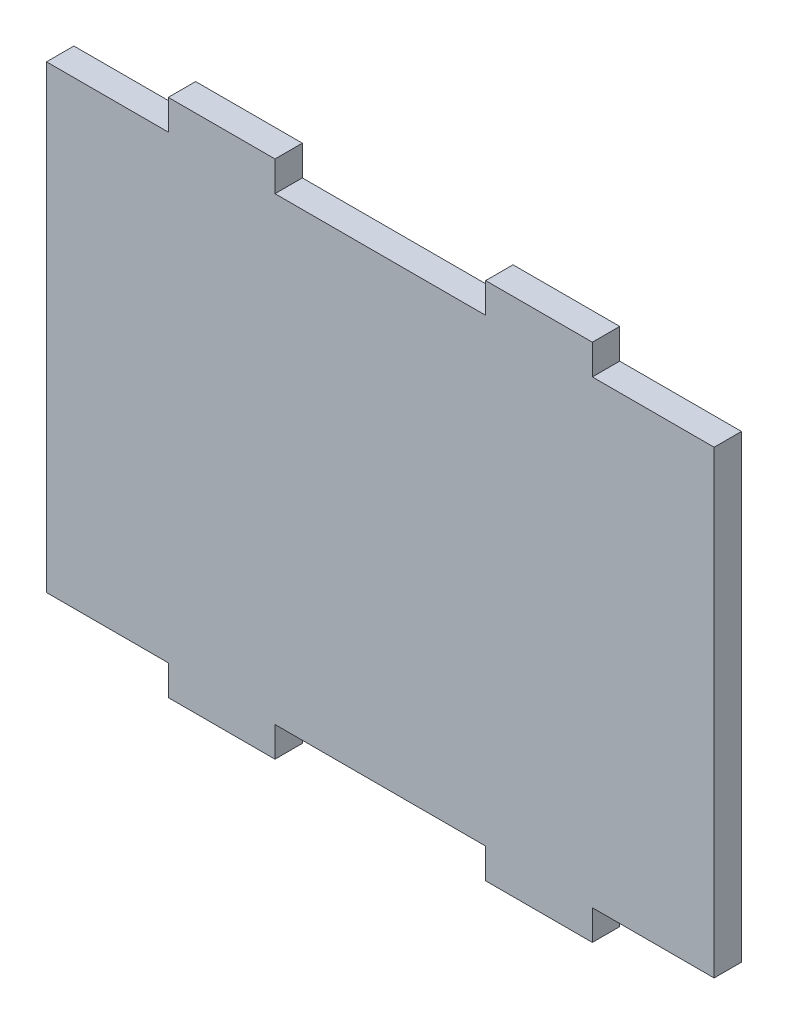
ISO-10303-21;
HEADER;
FILE_DESCRIPTION(('STEP AP214'),'2;1');
FILE_NAME('part.step','',(''),(''),'','','');
FILE_SCHEMA(('AUTOMOTIVE_DESIGN { 1 0 10303 214 1 1 1 1 }'));
ENDSEC;
DATA;
#1=APPLICATION_CONTEXT('core data for automotive mechanical design processes');
#2=APPLICATION_PROTOCOL_DEFINITION('international standard','automotive_design',2000,#1);
#3=PRODUCT_CONTEXT('',#1,'mechanical');
#4=PRODUCT('Part','Part','',(#3));
#5=PRODUCT_RELATED_PRODUCT_CATEGORY('part','',(#4));
#6=PRODUCT_DEFINITION_FORMATION('','',#4);
#7=PRODUCT_DEFINITION_CONTEXT('part definition',#1,'design');
#8=PRODUCT_DEFINITION('design','',#6,#7);
#9=PRODUCT_DEFINITION_SHAPE('','',#8);
#10=(LENGTH_UNIT() NAMED_UNIT(*) SI_UNIT(.MILLI.,.METRE.));
#11=(NAMED_UNIT(*) PLANE_ANGLE_UNIT() SI_UNIT($,.RADIAN.));
#12=(NAMED_UNIT(*) SI_UNIT($,.STERADIAN.) SOLID_ANGLE_UNIT());
#13=UNCERTAINTY_MEASURE_WITH_UNIT(LENGTH_MEASURE(1.E-05),#10,'distance_accuracy_value','');
#14=(GEOMETRIC_REPRESENTATION_CONTEXT(3) GLOBAL_UNCERTAINTY_ASSIGNED_CONTEXT((#13)) GLOBAL_UNIT_ASSIGNED_CONTEXT((#10,
#11,#12)) REPRESENTATION_CONTEXT('',''));
#15=CARTESIAN_POINT('',(0.,0.,0.));
#16=DIRECTION('',(0.,0.,1.));
#17=DIRECTION('',(1.,0.,0.));
#18=AXIS2_PLACEMENT_3D('',#15,#16,#17);
#19=CARTESIAN_POINT('',(-19.25,47.5,5.));
#20=DIRECTION('',(-1.,0.,0.));
#21=DIRECTION('',(0.,0.,1.));
#22=AXIS2_PLACEMENT_3D('',#19,#20,#21);
#23=PLANE('',#22);
#24=DIRECTION('',(0.,1.,0.));
#25=VECTOR('',#24,1.);
#26=CARTESIAN_POINT('',(-19.25,47.5,0.));
#27=LINE('',#26,#25);
#28=CARTESIAN_POINT('',(-19.25,42.,0.));
#29=VERTEX_POINT('',#28);
#30=CARTESIAN_POINT('',(-19.25,47.5,0.));
#31=VERTEX_POINT('',#30);
#32=EDGE_CURVE('E201',#29,#31,#27,.T.);
#33=ORIENTED_EDGE('',*,*,#32,.T.);
#34=DIRECTION('',(0.,0.,-1.));
#35=VECTOR('',#34,1.);
#36=CARTESIAN_POINT('',(-19.25,47.5,5.));
#37=LINE('',#36,#35);
#38=CARTESIAN_POINT('',(-19.25,47.5,5.));
#39=VERTEX_POINT('',#38);
#40=EDGE_CURVE('E11',#39,#31,#37,.T.);
#41=ORIENTED_EDGE('',*,*,#40,.F.);
#42=DIRECTION('',(0.,1.,0.));
#43=VECTOR('',#42,1.);
#44=CARTESIAN_POINT('',(-19.25,47.5,5.));
#45=LINE('',#44,#43);
#46=CARTESIAN_POINT('',(-19.25,42.,5.));
#47=VERTEX_POINT('',#46);
#48=EDGE_CURVE('E239',#47,#39,#45,.T.);
#49=ORIENTED_EDGE('',*,*,#48,.F.);
#50=DIRECTION('',(0.,0.,-1.));
#51=VECTOR('',#50,1.);
#52=CARTESIAN_POINT('',(-19.25,42.,5.));
#53=LINE('',#52,#51);
#54=EDGE_CURVE('E197',#47,#29,#53,.T.);
#55=ORIENTED_EDGE('',*,*,#54,.T.);
#56=EDGE_LOOP('',(#33,#41,#49,#55));
#57=FACE_BOUND('',#56,.T.);
#58=ADVANCED_FACE('F33',(#57),#23,.F.);
#59=CARTESIAN_POINT('',(-38.75,47.5,5.));
#60=DIRECTION('',(0.,-1.,0.));
#61=DIRECTION('',(0.,0.,-1.));
#62=AXIS2_PLACEMENT_3D('',#59,#60,#61);
#63=PLANE('',#62);
#64=DIRECTION('',(-1.,0.,0.));
#65=VECTOR('',#64,1.);
#66=CARTESIAN_POINT('',(-38.75,47.5,0.));
#67=LINE('',#66,#65);
#68=CARTESIAN_POINT('',(-38.75,47.5,0.));
#69=VERTEX_POINT('',#68);
#70=EDGE_CURVE('E204',#31,#69,#67,.T.);
#71=ORIENTED_EDGE('',*,*,#70,.T.);
#72=DIRECTION('',(0.,0.,-1.));
#73=VECTOR('',#72,1.);
#74=CARTESIAN_POINT('',(-38.75,47.5,5.));
#75=LINE('',#74,#73);
#76=CARTESIAN_POINT('',(-38.75,47.5,5.));
#77=VERTEX_POINT('',#76);
#78=EDGE_CURVE('E41',#77,#69,#75,.T.);
#79=ORIENTED_EDGE('',*,*,#78,.F.);
#80=DIRECTION('',(-1.,0.,0.));
#81=VECTOR('',#80,1.);
#82=CARTESIAN_POINT('',(-38.75,47.5,5.));
#83=LINE('',#82,#81);
#84=EDGE_CURVE('E128',#39,#77,#83,.T.);
#85=ORIENTED_EDGE('',*,*,#84,.F.);
#86=ORIENTED_EDGE('',*,*,#40,.T.);
#87=EDGE_LOOP('',(#71,#79,#85,#86));
#88=FACE_BOUND('',#87,.T.);
#89=ADVANCED_FACE('F357',(#88),#63,.F.);
#90=CARTESIAN_POINT('',(-38.75,42.,5.));
#91=DIRECTION('',(1.,0.,0.));
#92=DIRECTION('',(0.,0.,-1.));
#93=AXIS2_PLACEMENT_3D('',#90,#91,#92);
#94=PLANE('',#93);
#95=DIRECTION('',(0.,-1.,0.));
#96=VECTOR('',#95,1.);
#97=CARTESIAN_POINT('',(-38.75,42.,0.));
#98=LINE('',#97,#96);
#99=CARTESIAN_POINT('',(-38.75,42.,0.));
#100=VERTEX_POINT('',#99);
#101=EDGE_CURVE('E206',#69,#100,#98,.T.);
#102=ORIENTED_EDGE('',*,*,#101,.T.);
#103=DIRECTION('',(0.,0.,-1.));
#104=VECTOR('',#103,1.);
#105=CARTESIAN_POINT('',(-38.75,42.,5.));
#106=LINE('',#105,#104);
#107=CARTESIAN_POINT('',(-38.75,42.,5.));
#108=VERTEX_POINT('',#107);
#109=EDGE_CURVE('E282',#108,#100,#106,.T.);
#110=ORIENTED_EDGE('',*,*,#109,.F.);
#111=DIRECTION('',(0.,-1.,0.));
#112=VECTOR('',#111,1.);
#113=CARTESIAN_POINT('',(-38.75,42.,5.));
#114=LINE('',#113,#112);
#115=EDGE_CURVE('E290',#77,#108,#114,.T.);
#116=ORIENTED_EDGE('',*,*,#115,.F.);
#117=ORIENTED_EDGE('',*,*,#78,.T.);
#118=EDGE_LOOP('',(#102,#110,#116,#117));
#119=FACE_BOUND('',#118,.T.);
#120=ADVANCED_FACE('F288',(#119),#94,.F.);
#121=CARTESIAN_POINT('',(-61.,42.,5.));
#122=DIRECTION('',(0.,-1.,0.));
#123=DIRECTION('',(1.,0.,0.));
#124=AXIS2_PLACEMENT_3D('',#121,#122,#123);
#125=PLANE('',#124);
#126=DIRECTION('',(-1.,0.,0.));
#127=VECTOR('',#126,1.);
#128=CARTESIAN_POINT('',(-61.,42.,0.));
#129=LINE('',#128,#127);
#130=CARTESIAN_POINT('',(-61.,42.,0.));
#131=VERTEX_POINT('',#130);
#132=EDGE_CURVE('E208',#100,#131,#129,.T.);
#133=ORIENTED_EDGE('',*,*,#132,.T.);
#134=DIRECTION('',(0.,0.,-1.));
#135=VECTOR('',#134,1.);
#136=CARTESIAN_POINT('',(-61.,42.,5.));
#137=LINE('',#136,#135);
#138=CARTESIAN_POINT('',(-61.,42.,5.));
#139=VERTEX_POINT('',#138);
#140=EDGE_CURVE('E279',#139,#131,#137,.T.);
#141=ORIENTED_EDGE('',*,*,#140,.F.);
#142=DIRECTION('',(-1.,0.,0.));
#143=VECTOR('',#142,1.);
#144=CARTESIAN_POINT('',(-61.,42.,5.));
#145=LINE('',#144,#143);
#146=EDGE_CURVE('E308',#108,#139,#145,.T.);
#147=ORIENTED_EDGE('',*,*,#146,.F.);
#148=ORIENTED_EDGE('',*,*,#109,.T.);
#149=EDGE_LOOP('',(#133,#141,#147,#148));
#150=FACE_BOUND('',#149,.T.);
#151=ADVANCED_FACE('F299',(#150),#125,.F.);
#152=CARTESIAN_POINT('',(-61.,-42.,5.));
#153=DIRECTION('',(1.,0.,0.));
#154=DIRECTION('',(0.,0.,-1.));
#155=AXIS2_PLACEMENT_3D('',#152,#153,#154);
#156=PLANE('',#155);
#157=DIRECTION('',(0.,-1.,0.));
#158=VECTOR('',#157,1.);
#159=CARTESIAN_POINT('',(-61.,-42.,0.));
#160=LINE('',#159,#158);
#161=CARTESIAN_POINT('',(-61.,-42.,0.));
#162=VERTEX_POINT('',#161);
#163=EDGE_CURVE('E210',#131,#162,#160,.T.);
#164=ORIENTED_EDGE('',*,*,#163,.T.);
#165=DIRECTION('',(0.,0.,-1.));
#166=VECTOR('',#165,1.);
#167=CARTESIAN_POINT('',(-61.,-42.,5.));
#168=LINE('',#167,#166);
#169=CARTESIAN_POINT('',(-61.,-42.,5.));
#170=VERTEX_POINT('',#169);
#171=EDGE_CURVE('E276',#170,#162,#168,.T.);
#172=ORIENTED_EDGE('',*,*,#171,.F.);
#173=DIRECTION('',(0.,-1.,0.));
#174=VECTOR('',#173,1.);
#175=CARTESIAN_POINT('',(-61.,-42.,5.));
#176=LINE('',#175,#174);
#177=EDGE_CURVE('E305',#139,#170,#176,.T.);
#178=ORIENTED_EDGE('',*,*,#177,.F.);
#179=ORIENTED_EDGE('',*,*,#140,.T.);
#180=EDGE_LOOP('',(#164,#172,#178,#179));
#181=FACE_BOUND('',#180,.T.);
#182=ADVANCED_FACE('F303',(#181),#156,.F.);
#183=CARTESIAN_POINT('',(-61.,-42.,5.));
#184=DIRECTION('',(0.,1.,0.));
#185=DIRECTION('',(0.,0.,1.));
#186=AXIS2_PLACEMENT_3D('',#183,#184,#185);
#187=PLANE('',#186);
#188=DIRECTION('',(1.,0.,0.));
#189=VECTOR('',#188,1.);
#190=CARTESIAN_POINT('',(-61.,-42.,0.));
#191=LINE('',#190,#189);
#192=CARTESIAN_POINT('',(-38.75,-42.,0.));
#193=VERTEX_POINT('',#192);
#194=EDGE_CURVE('E212',#162,#193,#191,.T.);
#195=ORIENTED_EDGE('',*,*,#194,.T.);
#196=DIRECTION('',(0.,0.,-1.));
#197=VECTOR('',#196,1.);
#198=CARTESIAN_POINT('',(-38.75,-42.,5.));
#199=LINE('',#198,#197);
#200=CARTESIAN_POINT('',(-38.75,-42.,5.));
#201=VERTEX_POINT('',#200);
#202=EDGE_CURVE('E273',#201,#193,#199,.T.);
#203=ORIENTED_EDGE('',*,*,#202,.F.);
#204=DIRECTION('',(1.,0.,0.));
#205=VECTOR('',#204,1.);
#206=CARTESIAN_POINT('',(-61.,-42.,5.));
#207=LINE('',#206,#205);
#208=EDGE_CURVE('E307',#170,#201,#207,.T.);
#209=ORIENTED_EDGE('',*,*,#208,.F.);
#210=ORIENTED_EDGE('',*,*,#171,.T.);
#211=EDGE_LOOP('',(#195,#203,#209,#210));
#212=FACE_BOUND('',#211,.T.);
#213=ADVANCED_FACE('F370',(#212),#187,.F.);
#214=CARTESIAN_POINT('',(-38.75,-42.,5.));
#215=DIRECTION('',(1.,0.,0.));
#216=DIRECTION('',(0.,0.,-1.));
#217=AXIS2_PLACEMENT_3D('',#214,#215,#216);
#218=PLANE('',#217);
#219=DIRECTION('',(0.,-1.,0.));
#220=VECTOR('',#219,1.);
#221=CARTESIAN_POINT('',(-38.75,-42.,0.));
#222=LINE('',#221,#220);
#223=CARTESIAN_POINT('',(-38.75,-47.5,0.));
#224=VERTEX_POINT('',#223);
#225=EDGE_CURVE('E214',#193,#224,#222,.T.);
#226=ORIENTED_EDGE('',*,*,#225,.T.);
#227=DIRECTION('',(0.,0.,-1.));
#228=VECTOR('',#227,1.);
#229=CARTESIAN_POINT('',(-38.75,-47.5,5.));
#230=LINE('',#229,#228);
#231=CARTESIAN_POINT('',(-38.75,-47.5,5.));
#232=VERTEX_POINT('',#231);
#233=EDGE_CURVE('E270',#232,#224,#230,.T.);
#234=ORIENTED_EDGE('',*,*,#233,.F.);
#235=DIRECTION('',(0.,-1.,0.));
#236=VECTOR('',#235,1.);
#237=CARTESIAN_POINT('',(-38.75,-42.,5.));
#238=LINE('',#237,#236);
#239=EDGE_CURVE('E310',#201,#232,#238,.T.);
#240=ORIENTED_EDGE('',*,*,#239,.F.);
#241=ORIENTED_EDGE('',*,*,#202,.T.);
#242=EDGE_LOOP('',(#226,#234,#240,#241));
#243=FACE_BOUND('',#242,.T.);
#244=ADVANCED_FACE('F373',(#243),#218,.F.);
#245=CARTESIAN_POINT('',(-38.75,-47.5,5.));
#246=DIRECTION('',(0.,1.,0.));
#247=DIRECTION('',(0.,0.,1.));
#248=AXIS2_PLACEMENT_3D('',#245,#246,#247);
#249=PLANE('',#248);
#250=DIRECTION('',(1.,0.,0.));
#251=VECTOR('',#250,1.);
#252=CARTESIAN_POINT('',(-38.75,-47.5,0.));
#253=LINE('',#252,#251);
#254=CARTESIAN_POINT('',(-19.25,-47.5,0.));
#255=VERTEX_POINT('',#254);
#256=EDGE_CURVE('E216',#224,#255,#253,.T.);
#257=ORIENTED_EDGE('',*,*,#256,.T.);
#258=DIRECTION('',(0.,0.,-1.));
#259=VECTOR('',#258,1.);
#260=CARTESIAN_POINT('',(-19.25,-47.5,5.));
#261=LINE('',#260,#259);
#262=CARTESIAN_POINT('',(-19.25,-47.5,5.));
#263=VERTEX_POINT('',#262);
#264=EDGE_CURVE('E267',#263,#255,#261,.T.);
#265=ORIENTED_EDGE('',*,*,#264,.F.);
#266=DIRECTION('',(1.,0.,0.));
#267=VECTOR('',#266,1.);
#268=CARTESIAN_POINT('',(-38.75,-47.5,5.));
#269=LINE('',#268,#267);
#270=EDGE_CURVE('E316',#232,#263,#269,.T.);
#271=ORIENTED_EDGE('',*,*,#270,.F.);
#272=ORIENTED_EDGE('',*,*,#233,.T.);
#273=EDGE_LOOP('',(#257,#265,#271,#272));
#274=FACE_BOUND('',#273,.T.);
#275=ADVANCED_FACE('F377',(#274),#249,.F.);
#276=CARTESIAN_POINT('',(-19.25,-47.5,5.));
#277=DIRECTION('',(-1.,0.,0.));
#278=DIRECTION('',(0.,0.,1.));
#279=AXIS2_PLACEMENT_3D('',#276,#277,#278);
#280=PLANE('',#279);
#281=DIRECTION('',(0.,1.,0.));
#282=VECTOR('',#281,1.);
#283=CARTESIAN_POINT('',(-19.25,-47.5,0.));
#284=LINE('',#283,#282);
#285=CARTESIAN_POINT('',(-19.25,-42.,0.));
#286=VERTEX_POINT('',#285);
#287=EDGE_CURVE('E218',#255,#286,#284,.T.);
#288=ORIENTED_EDGE('',*,*,#287,.T.);
#289=DIRECTION('',(0.,0.,-1.));
#290=VECTOR('',#289,1.);
#291=CARTESIAN_POINT('',(-19.25,-42.,5.));
#292=LINE('',#291,#290);
#293=CARTESIAN_POINT('',(-19.25,-42.,5.));
#294=VERTEX_POINT('',#293);
#295=EDGE_CURVE('E264',#294,#286,#292,.T.);
#296=ORIENTED_EDGE('',*,*,#295,.F.);
#297=DIRECTION('',(0.,1.,0.));
#298=VECTOR('',#297,1.);
#299=CARTESIAN_POINT('',(-19.25,-47.5,5.));
#300=LINE('',#299,#298);
#301=EDGE_CURVE('E318',#263,#294,#300,.T.);
#302=ORIENTED_EDGE('',*,*,#301,.F.);
#303=ORIENTED_EDGE('',*,*,#264,.T.);
#304=EDGE_LOOP('',(#288,#296,#302,#303));
#305=FACE_BOUND('',#304,.T.);
#306=ADVANCED_FACE('F381',(#305),#280,.F.);
#307=CARTESIAN_POINT('',(-19.25,-42.,5.));
#308=DIRECTION('',(0.,1.,0.));
#309=DIRECTION('',(0.,0.,1.));
#310=AXIS2_PLACEMENT_3D('',#307,#308,#309);
#311=PLANE('',#310);
#312=DIRECTION('',(1.,0.,0.));
#313=VECTOR('',#312,1.);
#314=CARTESIAN_POINT('',(-19.25,-42.,0.));
#315=LINE('',#314,#313);
#316=CARTESIAN_POINT('',(19.25,-42.,0.));
#317=VERTEX_POINT('',#316);
#318=EDGE_CURVE('E220',#286,#317,#315,.T.);
#319=ORIENTED_EDGE('',*,*,#318,.T.);
#320=DIRECTION('',(0.,0.,-1.));
#321=VECTOR('',#320,1.);
#322=CARTESIAN_POINT('',(19.25,-42.,5.));
#323=LINE('',#322,#321);
#324=CARTESIAN_POINT('',(19.25,-42.,5.));
#325=VERTEX_POINT('',#324);
#326=EDGE_CURVE('E261',#325,#317,#323,.T.);
#327=ORIENTED_EDGE('',*,*,#326,.F.);
#328=DIRECTION('',(1.,0.,0.));
#329=VECTOR('',#328,1.);
#330=CARTESIAN_POINT('',(-19.25,-42.,5.));
#331=LINE('',#330,#329);
#332=EDGE_CURVE('E320',#294,#325,#331,.T.);
#333=ORIENTED_EDGE('',*,*,#332,.F.);
#334=ORIENTED_EDGE('',*,*,#295,.T.);
#335=EDGE_LOOP('',(#319,#327,#333,#334));
#336=FACE_BOUND('',#335,.T.);
#337=ADVANCED_FACE('F385',(#336),#311,.F.);
#338=CARTESIAN_POINT('',(19.25,-47.5,5.));
#339=DIRECTION('',(1.,0.,0.));
#340=DIRECTION('',(0.,0.,-1.));
#341=AXIS2_PLACEMENT_3D('',#338,#339,#340);
#342=PLANE('',#341);
#343=DIRECTION('',(0.,-1.,0.));
#344=VECTOR('',#343,1.);
#345=CARTESIAN_POINT('',(19.25,-47.5,0.));
#346=LINE('',#345,#344);
#347=CARTESIAN_POINT('',(19.25,-47.5,0.));
#348=VERTEX_POINT('',#347);
#349=EDGE_CURVE('E222',#317,#348,#346,.T.);
#350=ORIENTED_EDGE('',*,*,#349,.T.);
#351=DIRECTION('',(0.,0.,-1.));
#352=VECTOR('',#351,1.);
#353=CARTESIAN_POINT('',(19.25,-47.5,5.));
#354=LINE('',#353,#352);
#355=CARTESIAN_POINT('',(19.25,-47.5,5.));
#356=VERTEX_POINT('',#355);
#357=EDGE_CURVE('E258',#356,#348,#354,.T.);
#358=ORIENTED_EDGE('',*,*,#357,.F.);
#359=DIRECTION('',(0.,-1.,0.));
#360=VECTOR('',#359,1.);
#361=CARTESIAN_POINT('',(19.25,-47.5,5.));
#362=LINE('',#361,#360);
#363=EDGE_CURVE('E322',#325,#356,#362,.T.);
#364=ORIENTED_EDGE('',*,*,#363,.F.);
#365=ORIENTED_EDGE('',*,*,#326,.T.);
#366=EDGE_LOOP('',(#350,#358,#364,#365));
#367=FACE_BOUND('',#366,.T.);
#368=ADVANCED_FACE('F389',(#367),#342,.F.);
#369=CARTESIAN_POINT('',(38.75,-47.5,5.));
#370=DIRECTION('',(0.,1.,0.));
#371=DIRECTION('',(0.,0.,1.));
#372=AXIS2_PLACEMENT_3D('',#369,#370,#371);
#373=PLANE('',#372);
#374=DIRECTION('',(1.,0.,0.));
#375=VECTOR('',#374,1.);
#376=CARTESIAN_POINT('',(38.75,-47.5,0.));
#377=LINE('',#376,#375);
#378=CARTESIAN_POINT('',(38.75,-47.5,0.));
#379=VERTEX_POINT('',#378);
#380=EDGE_CURVE('E224',#348,#379,#377,.T.);
#381=ORIENTED_EDGE('',*,*,#380,.T.);
#382=DIRECTION('',(0.,0.,-1.));
#383=VECTOR('',#382,1.);
#384=CARTESIAN_POINT('',(38.75,-47.5,5.));
#385=LINE('',#384,#383);
#386=CARTESIAN_POINT('',(38.75,-47.5,5.));
#387=VERTEX_POINT('',#386);
#388=EDGE_CURVE('E255',#387,#379,#385,.T.);
#389=ORIENTED_EDGE('',*,*,#388,.F.);
#390=DIRECTION('',(1.,0.,0.));
#391=VECTOR('',#390,1.);
#392=CARTESIAN_POINT('',(38.75,-47.5,5.));
#393=LINE('',#392,#391);
#394=EDGE_CURVE('E324',#356,#387,#393,.T.);
#395=ORIENTED_EDGE('',*,*,#394,.F.);
#396=ORIENTED_EDGE('',*,*,#357,.T.);
#397=EDGE_LOOP('',(#381,#389,#395,#396));
#398=FACE_BOUND('',#397,.T.);
#399=ADVANCED_FACE('F393',(#398),#373,.F.);
#400=CARTESIAN_POINT('',(38.75,-42.,5.));
#401=DIRECTION('',(-1.,0.,0.));
#402=DIRECTION('',(0.,0.,1.));
#403=AXIS2_PLACEMENT_3D('',#400,#401,#402);
#404=PLANE('',#403);
#405=DIRECTION('',(0.,1.,0.));
#406=VECTOR('',#405,1.);
#407=CARTESIAN_POINT('',(38.75,-42.,0.));
#408=LINE('',#407,#406);
#409=CARTESIAN_POINT('',(38.75,-42.,0.));
#410=VERTEX_POINT('',#409);
#411=EDGE_CURVE('E226',#379,#410,#408,.T.);
#412=ORIENTED_EDGE('',*,*,#411,.T.);
#413=DIRECTION('',(0.,0.,-1.));
#414=VECTOR('',#413,1.);
#415=CARTESIAN_POINT('',(38.75,-42.,5.));
#416=LINE('',#415,#414);
#417=CARTESIAN_POINT('',(38.75,-42.,5.));
#418=VERTEX_POINT('',#417);
#419=EDGE_CURVE('E252',#418,#410,#416,.T.);
#420=ORIENTED_EDGE('',*,*,#419,.F.);
#421=DIRECTION('',(0.,1.,0.));
#422=VECTOR('',#421,1.);
#423=CARTESIAN_POINT('',(38.75,-42.,5.));
#424=LINE('',#423,#422);
#425=EDGE_CURVE('E326',#387,#418,#424,.T.);
#426=ORIENTED_EDGE('',*,*,#425,.F.);
#427=ORIENTED_EDGE('',*,*,#388,.T.);
#428=EDGE_LOOP('',(#412,#420,#426,#427));
#429=FACE_BOUND('',#428,.T.);
#430=ADVANCED_FACE('F397',(#429),#404,.F.);
#431=CARTESIAN_POINT('',(61.,-42.,5.));
#432=DIRECTION('',(0.,1.,0.));
#433=DIRECTION('',(0.,0.,1.));
#434=AXIS2_PLACEMENT_3D('',#431,#432,#433);
#435=PLANE('',#434);
#436=DIRECTION('',(1.,0.,0.));
#437=VECTOR('',#436,1.);
#438=CARTESIAN_POINT('',(61.,-42.,0.));
#439=LINE('',#438,#437);
#440=CARTESIAN_POINT('',(61.,-42.,0.));
#441=VERTEX_POINT('',#440);
#442=EDGE_CURVE('E228',#410,#441,#439,.T.);
#443=ORIENTED_EDGE('',*,*,#442,.T.);
#444=DIRECTION('',(0.,0.,-1.));
#445=VECTOR('',#444,1.);
#446=CARTESIAN_POINT('',(61.,-42.,5.));
#447=LINE('',#446,#445);
#448=CARTESIAN_POINT('',(61.,-42.,5.));
#449=VERTEX_POINT('',#448);
#450=EDGE_CURVE('E249',#449,#441,#447,.T.);
#451=ORIENTED_EDGE('',*,*,#450,.F.);
#452=DIRECTION('',(1.,0.,0.));
#453=VECTOR('',#452,1.);
#454=CARTESIAN_POINT('',(61.,-42.,5.));
#455=LINE('',#454,#453);
#456=EDGE_CURVE('E328',#418,#449,#455,.T.);
#457=ORIENTED_EDGE('',*,*,#456,.F.);
#458=ORIENTED_EDGE('',*,*,#419,.T.);
#459=EDGE_LOOP('',(#443,#451,#457,#458));
#460=FACE_BOUND('',#459,.T.);
#461=ADVANCED_FACE('F401',(#460),#435,.F.);
#462=CARTESIAN_POINT('',(61.,-42.,5.));
#463=DIRECTION('',(-1.,0.,0.));
#464=DIRECTION('',(0.,0.,1.));
#465=AXIS2_PLACEMENT_3D('',#462,#463,#464);
#466=PLANE('',#465);
#467=DIRECTION('',(0.,1.,0.));
#468=VECTOR('',#467,1.);
#469=CARTESIAN_POINT('',(61.,-42.,0.));
#470=LINE('',#469,#468);
#471=CARTESIAN_POINT('',(61.,42.,0.));
#472=VERTEX_POINT('',#471);
#473=EDGE_CURVE('E230',#441,#472,#470,.T.);
#474=ORIENTED_EDGE('',*,*,#473,.T.);
#475=DIRECTION('',(0.,0.,-1.));
#476=VECTOR('',#475,1.);
#477=CARTESIAN_POINT('',(61.,42.,5.));
#478=LINE('',#477,#476);
#479=CARTESIAN_POINT('',(61.,42.,5.));
#480=VERTEX_POINT('',#479);
#481=EDGE_CURVE('E246',#480,#472,#478,.T.);
#482=ORIENTED_EDGE('',*,*,#481,.F.);
#483=DIRECTION('',(0.,1.,0.));
#484=VECTOR('',#483,1.);
#485=CARTESIAN_POINT('',(61.,-42.,5.));
#486=LINE('',#485,#484);
#487=EDGE_CURVE('E330',#449,#480,#486,.T.);
#488=ORIENTED_EDGE('',*,*,#487,.F.);
#489=ORIENTED_EDGE('',*,*,#450,.T.);
#490=EDGE_LOOP('',(#474,#482,#488,#489));
#491=FACE_BOUND('',#490,.T.);
#492=ADVANCED_FACE('F405',(#491),#466,.F.);
#493=CARTESIAN_POINT('',(61.,42.,5.));
#494=DIRECTION('',(0.,-1.,0.));
#495=DIRECTION('',(0.,0.,-1.));
#496=AXIS2_PLACEMENT_3D('',#493,#494,#495);
#497=PLANE('',#496);
#498=DIRECTION('',(-1.,0.,0.));
#499=VECTOR('',#498,1.);
#500=CARTESIAN_POINT('',(61.,42.,0.));
#501=LINE('',#500,#499);
#502=CARTESIAN_POINT('',(38.75,42.,0.));
#503=VERTEX_POINT('',#502);
#504=EDGE_CURVE('E232',#472,#503,#501,.T.);
#505=ORIENTED_EDGE('',*,*,#504,.T.);
#506=DIRECTION('',(0.,0.,-1.));
#507=VECTOR('',#506,1.);
#508=CARTESIAN_POINT('',(38.75,42.,5.));
#509=LINE('',#508,#507);
#510=CARTESIAN_POINT('',(38.75,42.,5.));
#511=VERTEX_POINT('',#510);
#512=EDGE_CURVE('E243',#511,#503,#509,.T.);
#513=ORIENTED_EDGE('',*,*,#512,.F.);
#514=DIRECTION('',(-1.,0.,0.));
#515=VECTOR('',#514,1.);
#516=CARTESIAN_POINT('',(61.,42.,5.));
#517=LINE('',#516,#515);
#518=EDGE_CURVE('E332',#480,#511,#517,.T.);
#519=ORIENTED_EDGE('',*,*,#518,.F.);
#520=ORIENTED_EDGE('',*,*,#481,.T.);
#521=EDGE_LOOP('',(#505,#513,#519,#520));
#522=FACE_BOUND('',#521,.T.);
#523=ADVANCED_FACE('F338',(#522),#497,.F.);
#524=CARTESIAN_POINT('',(38.75,42.,5.));
#525=DIRECTION('',(-1.,0.,0.));
#526=DIRECTION('',(0.,0.,1.));
#527=AXIS2_PLACEMENT_3D('',#524,#525,#526);
#528=PLANE('',#527);
#529=DIRECTION('',(0.,1.,0.));
#530=VECTOR('',#529,1.);
#531=CARTESIAN_POINT('',(38.75,42.,0.));
#532=LINE('',#531,#530);
#533=CARTESIAN_POINT('',(38.75,47.5,0.));
#534=VERTEX_POINT('',#533);
#535=EDGE_CURVE('E234',#503,#534,#532,.T.);
#536=ORIENTED_EDGE('',*,*,#535,.T.);
#537=DIRECTION('',(0.,0.,-1.));
#538=VECTOR('',#537,1.);
#539=CARTESIAN_POINT('',(38.75,47.5,5.));
#540=LINE('',#539,#538);
#541=CARTESIAN_POINT('',(38.75,47.5,5.));
#542=VERTEX_POINT('',#541);
#543=EDGE_CURVE('E192',#542,#534,#540,.T.);
#544=ORIENTED_EDGE('',*,*,#543,.F.);
#545=DIRECTION('',(0.,1.,0.));
#546=VECTOR('',#545,1.);
#547=CARTESIAN_POINT('',(38.75,42.,5.));
#548=LINE('',#547,#546);
#549=EDGE_CURVE('E183',#511,#542,#548,.T.);
#550=ORIENTED_EDGE('',*,*,#549,.F.);
#551=ORIENTED_EDGE('',*,*,#512,.T.);
#552=EDGE_LOOP('',(#536,#544,#550,#551));
#553=FACE_BOUND('',#552,.T.);
#554=ADVANCED_FACE('F342',(#553),#528,.F.);
#555=CARTESIAN_POINT('',(38.75,47.5,5.));
#556=DIRECTION('',(0.,-1.,0.));
#557=DIRECTION('',(0.,0.,-1.));
#558=AXIS2_PLACEMENT_3D('',#555,#556,#557);
#559=PLANE('',#558);
#560=DIRECTION('',(-1.,0.,0.));
#561=VECTOR('',#560,1.);
#562=CARTESIAN_POINT('',(38.75,47.5,0.));
#563=LINE('',#562,#561);
#564=CARTESIAN_POINT('',(19.25,47.5,0.));
#565=VERTEX_POINT('',#564);
#566=EDGE_CURVE('E191',#534,#565,#563,.T.);
#567=ORIENTED_EDGE('',*,*,#566,.T.);
#568=DIRECTION('',(0.,0.,-1.));
#569=VECTOR('',#568,1.);
#570=CARTESIAN_POINT('',(19.25,47.5,5.));
#571=LINE('',#570,#569);
#572=CARTESIAN_POINT('',(19.25,47.5,5.));
#573=VERTEX_POINT('',#572);
#574=EDGE_CURVE('E188',#573,#565,#571,.T.);
#575=ORIENTED_EDGE('',*,*,#574,.F.);
#576=DIRECTION('',(-1.,0.,0.));
#577=VECTOR('',#576,1.);
#578=CARTESIAN_POINT('',(38.75,47.5,5.));
#579=LINE('',#578,#577);
#580=EDGE_CURVE('E177',#542,#573,#579,.T.);
#581=ORIENTED_EDGE('',*,*,#580,.F.);
#582=ORIENTED_EDGE('',*,*,#543,.T.);
#583=EDGE_LOOP('',(#567,#575,#581,#582));
#584=FACE_BOUND('',#583,.T.);
#585=ADVANCED_FACE('F189',(#584),#559,.F.);
#586=CARTESIAN_POINT('',(19.25,47.5,5.));
#587=DIRECTION('',(1.,0.,0.));
#588=DIRECTION('',(0.,0.,-1.));
#589=AXIS2_PLACEMENT_3D('',#586,#587,#588);
#590=PLANE('',#589);
#591=DIRECTION('',(0.,-1.,0.));
#592=VECTOR('',#591,1.);
#593=CARTESIAN_POINT('',(19.25,47.5,0.));
#594=LINE('',#593,#592);
#595=CARTESIAN_POINT('',(19.25,42.,0.));
#596=VERTEX_POINT('',#595);
#597=EDGE_CURVE('E114',#565,#596,#594,.T.);
#598=ORIENTED_EDGE('',*,*,#597,.T.);
#599=DIRECTION('',(0.,0.,-1.));
#600=VECTOR('',#599,1.);
#601=CARTESIAN_POINT('',(19.25,42.,5.));
#602=LINE('',#601,#600);
#603=CARTESIAN_POINT('',(19.25,42.,5.));
#604=VERTEX_POINT('',#603);
#605=EDGE_CURVE('E193',#604,#596,#602,.T.);
#606=ORIENTED_EDGE('',*,*,#605,.F.);
#607=DIRECTION('',(0.,-1.,0.));
#608=VECTOR('',#607,1.);
#609=CARTESIAN_POINT('',(19.25,47.5,5.));
#610=LINE('',#609,#608);
#611=EDGE_CURVE('E181',#573,#604,#610,.T.);
#612=ORIENTED_EDGE('',*,*,#611,.F.);
#613=ORIENTED_EDGE('',*,*,#574,.T.);
#614=EDGE_LOOP('',(#598,#606,#612,#613));
#615=FACE_BOUND('',#614,.T.);
#616=ADVANCED_FACE('F195',(#615),#590,.F.);
#617=CARTESIAN_POINT('',(-19.25,42.,5.));
#618=DIRECTION('',(0.,-1.,0.));
#619=DIRECTION('',(0.,0.,-1.));
#620=AXIS2_PLACEMENT_3D('',#617,#618,#619);
#621=PLANE('',#620);
#622=DIRECTION('',(-1.,0.,0.));
#623=VECTOR('',#622,1.);
#624=CARTESIAN_POINT('',(-19.25,42.,0.));
#625=LINE('',#624,#623);
#626=EDGE_CURVE('E120',#596,#29,#625,.T.);
#627=ORIENTED_EDGE('',*,*,#626,.T.);
#628=ORIENTED_EDGE('',*,*,#54,.F.);
#629=DIRECTION('',(-1.,0.,0.));
#630=VECTOR('',#629,1.);
#631=CARTESIAN_POINT('',(-19.25,42.,5.));
#632=LINE('',#631,#630);
#633=EDGE_CURVE('E49',#604,#47,#632,.T.);
#634=ORIENTED_EDGE('',*,*,#633,.F.);
#635=ORIENTED_EDGE('',*,*,#605,.T.);
#636=EDGE_LOOP('',(#627,#628,#634,#635));
#637=FACE_BOUND('',#636,.T.);
#638=ADVANCED_FACE('F346',(#637),#621,.F.);
#639=CARTESIAN_POINT('',(0.,0.,5.));
#640=DIRECTION('',(0.,0.,1.));
#641=DIRECTION('',(1.,0.,0.));
#642=AXIS2_PLACEMENT_3D('',#639,#640,#641);
#643=PLANE('',#642);
#644=ORIENTED_EDGE('',*,*,#48,.T.);
#645=ORIENTED_EDGE('',*,*,#84,.T.);
#646=ORIENTED_EDGE('',*,*,#115,.T.);
#647=ORIENTED_EDGE('',*,*,#146,.T.);
#648=ORIENTED_EDGE('',*,*,#177,.T.);
#649=ORIENTED_EDGE('',*,*,#208,.T.);
#650=ORIENTED_EDGE('',*,*,#239,.T.);
#651=ORIENTED_EDGE('',*,*,#270,.T.);
#652=ORIENTED_EDGE('',*,*,#301,.T.);
#653=ORIENTED_EDGE('',*,*,#332,.T.);
#654=ORIENTED_EDGE('',*,*,#363,.T.);
#655=ORIENTED_EDGE('',*,*,#394,.T.);
#656=ORIENTED_EDGE('',*,*,#425,.T.);
#657=ORIENTED_EDGE('',*,*,#456,.T.);
#658=ORIENTED_EDGE('',*,*,#487,.T.);
#659=ORIENTED_EDGE('',*,*,#518,.T.);
#660=ORIENTED_EDGE('',*,*,#549,.T.);
#661=ORIENTED_EDGE('',*,*,#580,.T.);
#662=ORIENTED_EDGE('',*,*,#611,.T.);
#663=ORIENTED_EDGE('',*,*,#633,.T.);
#664=EDGE_LOOP('',(#644,#645,#646,#647,#648,#649,#650,#651,#652,#653,#654,#655,#656,#657,#658,
#659,#660,#661,#662,#663));
#665=FACE_BOUND('',#664,.T.);
#666=ADVANCED_FACE('F179',(#665),#643,.T.);
#667=CARTESIAN_POINT('',(0.,0.,0.));
#668=DIRECTION('',(0.,0.,1.));
#669=DIRECTION('',(1.,0.,0.));
#670=AXIS2_PLACEMENT_3D('',#667,#668,#669);
#671=PLANE('',#670);
#672=ORIENTED_EDGE('',*,*,#32,.F.);
#673=ORIENTED_EDGE('',*,*,#626,.F.);
#674=ORIENTED_EDGE('',*,*,#597,.F.);
#675=ORIENTED_EDGE('',*,*,#566,.F.);
#676=ORIENTED_EDGE('',*,*,#535,.F.);
#677=ORIENTED_EDGE('',*,*,#504,.F.);
#678=ORIENTED_EDGE('',*,*,#473,.F.);
#679=ORIENTED_EDGE('',*,*,#442,.F.);
#680=ORIENTED_EDGE('',*,*,#411,.F.);
#681=ORIENTED_EDGE('',*,*,#380,.F.);
#682=ORIENTED_EDGE('',*,*,#349,.F.);
#683=ORIENTED_EDGE('',*,*,#318,.F.);
#684=ORIENTED_EDGE('',*,*,#287,.F.);
#685=ORIENTED_EDGE('',*,*,#256,.F.);
#686=ORIENTED_EDGE('',*,*,#225,.F.);
#687=ORIENTED_EDGE('',*,*,#194,.F.);
#688=ORIENTED_EDGE('',*,*,#163,.F.);
#689=ORIENTED_EDGE('',*,*,#132,.F.);
#690=ORIENTED_EDGE('',*,*,#101,.F.);
#691=ORIENTED_EDGE('',*,*,#70,.F.);
#692=EDGE_LOOP('',(#672,#673,#674,#675,#676,#677,#678,#679,#680,#681,#682,#683,#684,#685,#686,
#687,#688,#689,#690,#691));
#693=FACE_BOUND('',#692,.T.);
#694=ADVANCED_FACE('F294',(#693),#671,.F.);
#695=CLOSED_SHELL('',(#58,#89,#120,#151,#182,#213,#244,#275,#306,#337,#368,#399,#430,#461,#492,
#523,#554,#585,#616,#638,#666,#694));
#696=MANIFOLD_SOLID_BREP('B2',#695);
#697=ADVANCED_BREP_SHAPE_REPRESENTATION('',(#18,#696),#14);
#698=SHAPE_DEFINITION_REPRESENTATION(#9,#697);
ENDSEC;
END-ISO-10303-21;
